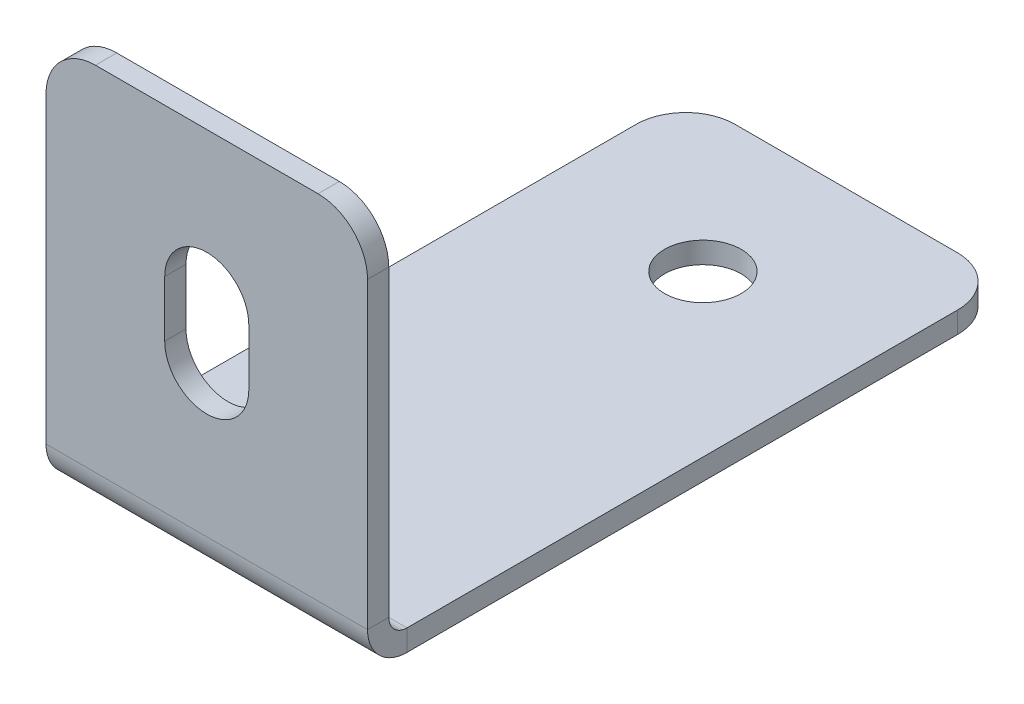
ISO-10303-21;
HEADER;
FILE_DESCRIPTION(('STEP AP214'),'2;1');
FILE_NAME('part.step','',(''),(''),'','','');
FILE_SCHEMA(('AUTOMOTIVE_DESIGN { 1 0 10303 214 1 1 1 1 }'));
ENDSEC;
DATA;
#1=APPLICATION_CONTEXT('core data for automotive mechanical design processes');
#2=APPLICATION_PROTOCOL_DEFINITION('international standard','automotive_design',2000,#1);
#3=PRODUCT_CONTEXT('',#1,'mechanical');
#4=PRODUCT('Part','Part','',(#3));
#5=PRODUCT_RELATED_PRODUCT_CATEGORY('part','',(#4));
#6=PRODUCT_DEFINITION_FORMATION('','',#4);
#7=PRODUCT_DEFINITION_CONTEXT('part definition',#1,'design');
#8=PRODUCT_DEFINITION('design','',#6,#7);
#9=PRODUCT_DEFINITION_SHAPE('','',#8);
#10=(LENGTH_UNIT() NAMED_UNIT(*) SI_UNIT(.MILLI.,.METRE.));
#11=(NAMED_UNIT(*) PLANE_ANGLE_UNIT() SI_UNIT($,.RADIAN.));
#12=(NAMED_UNIT(*) SI_UNIT($,.STERADIAN.) SOLID_ANGLE_UNIT());
#13=UNCERTAINTY_MEASURE_WITH_UNIT(LENGTH_MEASURE(1.E-05),#10,'distance_accuracy_value','');
#14=(GEOMETRIC_REPRESENTATION_CONTEXT(3) GLOBAL_UNCERTAINTY_ASSIGNED_CONTEXT((#13)) GLOBAL_UNIT_ASSIGNED_CONTEXT((#10,
#11,#12)) REPRESENTATION_CONTEXT('',''));
#15=CARTESIAN_POINT('',(0.,0.,0.));
#16=DIRECTION('',(0.,0.,1.));
#17=DIRECTION('',(1.,0.,0.));
#18=AXIS2_PLACEMENT_3D('',#15,#16,#17);
#19=CARTESIAN_POINT('',(0.,0.,13.36));
#20=DIRECTION('',(0.,0.,-1.));
#21=DIRECTION('',(-1.,0.,0.));
#22=AXIS2_PLACEMENT_3D('',#19,#20,#21);
#23=PLANE('',#22);
#24=DIRECTION('',(-1.,0.,0.));
#25=VECTOR('',#24,1.);
#26=CARTESIAN_POINT('',(-6.5,15.,13.36));
#27=LINE('',#26,#25);
#28=CARTESIAN_POINT('',(4.49999999999999,15.,13.36));
#29=VERTEX_POINT('',#28);
#30=CARTESIAN_POINT('',(-4.5,15.,13.36));
#31=VERTEX_POINT('',#30);
#32=EDGE_CURVE('E206',#29,#31,#27,.T.);
#33=ORIENTED_EDGE('',*,*,#32,.T.);
#34=CARTESIAN_POINT('',(-4.5,13.,13.36));
#35=DIRECTION('',(0.,0.,-1.));
#36=DIRECTION('',(-1.,0.,0.));
#37=AXIS2_PLACEMENT_3D('',#34,#35,#36);
#38=CIRCLE('',#37,2.);
#39=CARTESIAN_POINT('',(-6.5,13.,13.36));
#40=VERTEX_POINT('',#39);
#41=EDGE_CURVE('E269',#31,#40,#38,.F.);
#42=ORIENTED_EDGE('',*,*,#41,.T.);
#43=DIRECTION('',(0.,-1.,0.));
#44=VECTOR('',#43,1.);
#45=CARTESIAN_POINT('',(-6.5,0.,13.36));
#46=LINE('',#45,#44);
#47=CARTESIAN_POINT('',(-6.5,0.736599999999997,13.36));
#48=VERTEX_POINT('',#47);
#49=EDGE_CURVE('E200',#40,#48,#46,.T.);
#50=ORIENTED_EDGE('',*,*,#49,.T.);
#51=DIRECTION('',(-1.,0.,0.));
#52=VECTOR('',#51,1.);
#53=CARTESIAN_POINT('',(0.,0.736599999999997,13.36));
#54=LINE('',#53,#52);
#55=CARTESIAN_POINT('',(6.5,0.736599999999997,13.36));
#56=VERTEX_POINT('',#55);
#57=EDGE_CURVE('E194',#56,#48,#54,.T.);
#58=ORIENTED_EDGE('',*,*,#57,.F.);
#59=DIRECTION('',(0.,1.,0.));
#60=VECTOR('',#59,1.);
#61=CARTESIAN_POINT('',(6.5,15.,13.36));
#62=LINE('',#61,#60);
#63=CARTESIAN_POINT('',(6.5,13.,13.36));
#64=VERTEX_POINT('',#63);
#65=EDGE_CURVE('E202',#56,#64,#62,.T.);
#66=ORIENTED_EDGE('',*,*,#65,.T.);
#67=CARTESIAN_POINT('',(4.5,13.,13.36));
#68=DIRECTION('',(0.,0.,-1.));
#69=DIRECTION('',(-1.,0.,0.));
#70=AXIS2_PLACEMENT_3D('',#67,#68,#69);
#71=CIRCLE('',#70,2.);
#72=EDGE_CURVE('E267',#64,#29,#71,.F.);
#73=ORIENTED_EDGE('',*,*,#72,.T.);
#74=EDGE_LOOP('',(#33,#42,#50,#58,#66,#73));
#75=FACE_BOUND('',#74,.T.);
#76=DIRECTION('',(0.,-1.,0.));
#77=VECTOR('',#76,1.);
#78=CARTESIAN_POINT('',(-1.7,9.,13.36));
#79=LINE('',#78,#77);
#80=CARTESIAN_POINT('',(-1.7,9.,13.36));
#81=VERTEX_POINT('',#80);
#82=CARTESIAN_POINT('',(-1.7,6.7366,13.36));
#83=VERTEX_POINT('',#82);
#84=EDGE_CURVE('E146',#81,#83,#79,.T.);
#85=ORIENTED_EDGE('',*,*,#84,.F.);
#86=CARTESIAN_POINT('',(0.,9.,13.36));
#87=DIRECTION('',(0.,0.,-1.));
#88=DIRECTION('',(-1.,0.,0.));
#89=AXIS2_PLACEMENT_3D('',#86,#87,#88);
#90=CIRCLE('',#89,1.7);
#91=CARTESIAN_POINT('',(1.7,9.,13.36));
#92=VERTEX_POINT('',#91);
#93=EDGE_CURVE('E168',#81,#92,#90,.T.);
#94=ORIENTED_EDGE('',*,*,#93,.T.);
#95=DIRECTION('',(0.,-1.,0.));
#96=VECTOR('',#95,1.);
#97=CARTESIAN_POINT('',(1.7,9.,13.36));
#98=LINE('',#97,#96);
#99=CARTESIAN_POINT('',(1.7,6.7366,13.36));
#100=VERTEX_POINT('',#99);
#101=EDGE_CURVE('E50',#92,#100,#98,.T.);
#102=ORIENTED_EDGE('',*,*,#101,.T.);
#103=CARTESIAN_POINT('',(0.,6.7366,13.36));
#104=DIRECTION('',(0.,0.,-1.));
#105=DIRECTION('',(-1.,0.,0.));
#106=AXIS2_PLACEMENT_3D('',#103,#104,#105);
#107=CIRCLE('',#106,1.7);
#108=EDGE_CURVE('E156',#100,#83,#107,.T.);
#109=ORIENTED_EDGE('',*,*,#108,.T.);
#110=EDGE_LOOP('',(#85,#94,#102,#109));
#111=FACE_BOUND('',#110,.T.);
#112=ADVANCED_FACE('F35',(#75,#111),#23,.F.);
#113=CARTESIAN_POINT('',(0.,0.,12.5));
#114=DIRECTION('',(0.,0.,-1.));
#115=DIRECTION('',(-1.,0.,0.));
#116=AXIS2_PLACEMENT_3D('',#113,#114,#115);
#117=PLANE('',#116);
#118=DIRECTION('',(0.,-1.,0.));
#119=VECTOR('',#118,1.);
#120=CARTESIAN_POINT('',(-6.5,0.,12.5));
#121=LINE('',#120,#119);
#122=CARTESIAN_POINT('',(-6.5,13.,12.5));
#123=VERTEX_POINT('',#122);
#124=CARTESIAN_POINT('',(-6.5,0.736599999999997,12.5));
#125=VERTEX_POINT('',#124);
#126=EDGE_CURVE('E199',#123,#125,#121,.T.);
#127=ORIENTED_EDGE('',*,*,#126,.F.);
#128=CARTESIAN_POINT('',(-4.5,13.,12.5));
#129=DIRECTION('',(0.,0.,-1.));
#130=DIRECTION('',(-1.,0.,0.));
#131=AXIS2_PLACEMENT_3D('',#128,#129,#130);
#132=CIRCLE('',#131,2.);
#133=CARTESIAN_POINT('',(-4.5,15.,12.5));
#134=VERTEX_POINT('',#133);
#135=EDGE_CURVE('E260',#123,#134,#132,.T.);
#136=ORIENTED_EDGE('',*,*,#135,.T.);
#137=DIRECTION('',(-1.,0.,0.));
#138=VECTOR('',#137,1.);
#139=CARTESIAN_POINT('',(-6.5,15.,12.5));
#140=LINE('',#139,#138);
#141=CARTESIAN_POINT('',(4.49999999999999,15.,12.5));
#142=VERTEX_POINT('',#141);
#143=EDGE_CURVE('E203',#142,#134,#140,.T.);
#144=ORIENTED_EDGE('',*,*,#143,.F.);
#145=CARTESIAN_POINT('',(4.5,13.,12.5));
#146=DIRECTION('',(0.,0.,-1.));
#147=DIRECTION('',(-1.,0.,0.));
#148=AXIS2_PLACEMENT_3D('',#145,#146,#147);
#149=CIRCLE('',#148,2.);
#150=CARTESIAN_POINT('',(6.5,13.,12.5));
#151=VERTEX_POINT('',#150);
#152=EDGE_CURVE('E258',#142,#151,#149,.T.);
#153=ORIENTED_EDGE('',*,*,#152,.T.);
#154=DIRECTION('',(0.,1.,0.));
#155=VECTOR('',#154,1.);
#156=CARTESIAN_POINT('',(6.5,15.,12.5));
#157=LINE('',#156,#155);
#158=CARTESIAN_POINT('',(6.5,0.736599999999997,12.5));
#159=VERTEX_POINT('',#158);
#160=EDGE_CURVE('E211',#159,#151,#157,.T.);
#161=ORIENTED_EDGE('',*,*,#160,.F.);
#162=DIRECTION('',(1.,0.,0.));
#163=VECTOR('',#162,1.);
#164=CARTESIAN_POINT('',(-6.5,0.736599999999997,12.5));
#165=LINE('',#164,#163);
#166=EDGE_CURVE('E189',#125,#159,#165,.T.);
#167=ORIENTED_EDGE('',*,*,#166,.F.);
#168=EDGE_LOOP('',(#127,#136,#144,#153,#161,#167));
#169=FACE_BOUND('',#168,.T.);
#170=CARTESIAN_POINT('',(0.,9.,12.5));
#171=DIRECTION('',(0.,0.,-1.));
#172=DIRECTION('',(-1.,0.,0.));
#173=AXIS2_PLACEMENT_3D('',#170,#171,#172);
#174=CIRCLE('',#173,1.7);
#175=CARTESIAN_POINT('',(-1.7,9.,12.5));
#176=VERTEX_POINT('',#175);
#177=CARTESIAN_POINT('',(1.7,9.,12.5));
#178=VERTEX_POINT('',#177);
#179=EDGE_CURVE('E157',#176,#178,#174,.T.);
#180=ORIENTED_EDGE('',*,*,#179,.F.);
#181=DIRECTION('',(0.,-1.,0.));
#182=VECTOR('',#181,1.);
#183=CARTESIAN_POINT('',(-1.7,9.,12.5));
#184=LINE('',#183,#182);
#185=CARTESIAN_POINT('',(-1.7,6.7366,12.5));
#186=VERTEX_POINT('',#185);
#187=EDGE_CURVE('E58',#176,#186,#184,.T.);
#188=ORIENTED_EDGE('',*,*,#187,.T.);
#189=CARTESIAN_POINT('',(0.,6.7366,12.5));
#190=DIRECTION('',(0.,0.,-1.));
#191=DIRECTION('',(-1.,0.,0.));
#192=AXIS2_PLACEMENT_3D('',#189,#190,#191);
#193=CIRCLE('',#192,1.7);
#194=CARTESIAN_POINT('',(1.7,6.7366,12.5));
#195=VERTEX_POINT('',#194);
#196=EDGE_CURVE('E163',#195,#186,#193,.T.);
#197=ORIENTED_EDGE('',*,*,#196,.F.);
#198=DIRECTION('',(0.,-1.,0.));
#199=VECTOR('',#198,1.);
#200=CARTESIAN_POINT('',(1.7,9.,12.5));
#201=LINE('',#200,#199);
#202=EDGE_CURVE('E174',#178,#195,#201,.T.);
#203=ORIENTED_EDGE('',*,*,#202,.F.);
#204=EDGE_LOOP('',(#180,#188,#197,#203));
#205=FACE_BOUND('',#204,.T.);
#206=ADVANCED_FACE('F333',(#169,#205),#117,.T.);
#207=CARTESIAN_POINT('',(6.5,-0.86,12.5));
#208=DIRECTION('',(1.,0.,0.));
#209=DIRECTION('',(0.,0.,-1.));
#210=AXIS2_PLACEMENT_3D('',#207,#208,#209);
#211=PLANE('',#210);
#212=DIRECTION('',(0.,0.,-1.));
#213=VECTOR('',#212,1.);
#214=CARTESIAN_POINT('',(6.5,-0.86,12.5));
#215=LINE('',#214,#213);
#216=CARTESIAN_POINT('',(6.5,-0.860000000000004,11.7634));
#217=VERTEX_POINT('',#216);
#218=CARTESIAN_POINT('',(6.5,-0.86,-10.5));
#219=VERTEX_POINT('',#218);
#220=EDGE_CURVE('E240',#217,#219,#215,.T.);
#221=ORIENTED_EDGE('',*,*,#220,.T.);
#222=DIRECTION('',(0.,1.,0.));
#223=VECTOR('',#222,1.);
#224=CARTESIAN_POINT('',(6.5,-0.86,-10.5));
#225=LINE('',#224,#223);
#226=CARTESIAN_POINT('',(6.5,0.,-10.5));
#227=VERTEX_POINT('',#226);
#228=EDGE_CURVE('E11',#219,#227,#225,.T.);
#229=ORIENTED_EDGE('',*,*,#228,.T.);
#230=DIRECTION('',(0.,0.,-1.));
#231=VECTOR('',#230,1.);
#232=CARTESIAN_POINT('',(6.5,0.,12.5));
#233=LINE('',#232,#231);
#234=CARTESIAN_POINT('',(6.5,0.,11.7634));
#235=VERTEX_POINT('',#234);
#236=EDGE_CURVE('E237',#235,#227,#233,.T.);
#237=ORIENTED_EDGE('',*,*,#236,.F.);
#238=DIRECTION('',(0.,-1.,0.));
#239=VECTOR('',#238,1.);
#240=CARTESIAN_POINT('',(6.5,0.,11.7634));
#241=LINE('',#240,#239);
#242=EDGE_CURVE('E223',#235,#217,#241,.T.);
#243=ORIENTED_EDGE('',*,*,#242,.T.);
#244=EDGE_LOOP('',(#221,#229,#237,#243));
#245=FACE_BOUND('',#244,.T.);
#246=ADVANCED_FACE('F321',(#245),#211,.T.);
#247=CARTESIAN_POINT('',(0.,-0.86,0.));
#248=DIRECTION('',(0.,-1.,0.));
#249=DIRECTION('',(0.,0.,-1.));
#250=AXIS2_PLACEMENT_3D('',#247,#248,#249);
#251=PLANE('',#250);
#252=CARTESIAN_POINT('',(0.,-0.860000000000004,-6.70000000000001));
#253=DIRECTION('',(0.,1.,0.));
#254=DIRECTION('',(0.,0.,1.));
#255=AXIS2_PLACEMENT_3D('',#252,#253,#254);
#256=CIRCLE('',#255,1.55);
#257=CARTESIAN_POINT('',(0.,-0.860000000000004,-5.15000000000001));
#258=VERTEX_POINT('',#257);
#259=EDGE_CURVE('E183',#258,#258,#256,.T.);
#260=ORIENTED_EDGE('',*,*,#259,.T.);
#261=EDGE_LOOP('',(#260));
#262=FACE_BOUND('',#261,.T.);
#263=DIRECTION('',(0.,0.,1.));
#264=VECTOR('',#263,1.);
#265=CARTESIAN_POINT('',(-6.5,-0.86,12.5));
#266=LINE('',#265,#264);
#267=CARTESIAN_POINT('',(-6.5,-0.86,-10.5));
#268=VERTEX_POINT('',#267);
#269=CARTESIAN_POINT('',(-6.5,-0.86,11.7634));
#270=VERTEX_POINT('',#269);
#271=EDGE_CURVE('E247',#268,#270,#266,.T.);
#272=ORIENTED_EDGE('',*,*,#271,.F.);
#273=CARTESIAN_POINT('',(-4.5,-0.86,-10.5));
#274=DIRECTION('',(0.,-1.,0.));
#275=DIRECTION('',(0.,0.,-1.));
#276=AXIS2_PLACEMENT_3D('',#273,#274,#275);
#277=CIRCLE('',#276,2.);
#278=CARTESIAN_POINT('',(-4.5,-0.86,-12.5));
#279=VERTEX_POINT('',#278);
#280=EDGE_CURVE('E43',#268,#279,#277,.T.);
#281=ORIENTED_EDGE('',*,*,#280,.T.);
#282=DIRECTION('',(-1.,0.,0.));
#283=VECTOR('',#282,1.);
#284=CARTESIAN_POINT('',(-6.5,-0.86,-12.5));
#285=LINE('',#284,#283);
#286=CARTESIAN_POINT('',(4.5,-0.86,-12.5));
#287=VERTEX_POINT('',#286);
#288=EDGE_CURVE('E243',#287,#279,#285,.T.);
#289=ORIENTED_EDGE('',*,*,#288,.F.);
#290=CARTESIAN_POINT('',(4.5,-0.86,-10.5));
#291=DIRECTION('',(0.,-1.,0.));
#292=DIRECTION('',(0.,0.,-1.));
#293=AXIS2_PLACEMENT_3D('',#290,#291,#292);
#294=CIRCLE('',#293,2.);
#295=EDGE_CURVE('E284',#287,#219,#294,.T.);
#296=ORIENTED_EDGE('',*,*,#295,.T.);
#297=ORIENTED_EDGE('',*,*,#220,.F.);
#298=DIRECTION('',(1.,0.,0.));
#299=VECTOR('',#298,1.);
#300=CARTESIAN_POINT('',(6.5,-0.860000000000004,11.7634));
#301=LINE('',#300,#299);
#302=EDGE_CURVE('E216',#217,#270,#301,.F.);
#303=ORIENTED_EDGE('',*,*,#302,.T.);
#304=EDGE_LOOP('',(#272,#281,#289,#296,#297,#303));
#305=FACE_BOUND('',#304,.T.);
#306=ADVANCED_FACE('F289',(#262,#305),#251,.T.);
#307=CARTESIAN_POINT('',(0.,0.,0.));
#308=DIRECTION('',(0.,-1.,0.));
#309=DIRECTION('',(0.,0.,-1.));
#310=AXIS2_PLACEMENT_3D('',#307,#308,#309);
#311=PLANE('',#310);
#312=CARTESIAN_POINT('',(0.,0.,-6.70000000000001));
#313=DIRECTION('',(0.,1.,0.));
#314=DIRECTION('',(0.,0.,1.));
#315=AXIS2_PLACEMENT_3D('',#312,#313,#314);
#316=CIRCLE('',#315,1.55);
#317=CARTESIAN_POINT('',(0.,0.,-5.15000000000001));
#318=VERTEX_POINT('',#317);
#319=EDGE_CURVE('E164',#318,#318,#316,.T.);
#320=ORIENTED_EDGE('',*,*,#319,.F.);
#321=EDGE_LOOP('',(#320));
#322=FACE_BOUND('',#321,.T.);
#323=DIRECTION('',(-1.,0.,0.));
#324=VECTOR('',#323,1.);
#325=CARTESIAN_POINT('',(-6.5,0.,-12.5));
#326=LINE('',#325,#324);
#327=CARTESIAN_POINT('',(4.5,0.,-12.5));
#328=VERTEX_POINT('',#327);
#329=CARTESIAN_POINT('',(-4.5,0.,-12.5));
#330=VERTEX_POINT('',#329);
#331=EDGE_CURVE('E252',#328,#330,#326,.T.);
#332=ORIENTED_EDGE('',*,*,#331,.T.);
#333=CARTESIAN_POINT('',(-4.5,0.,-10.5));
#334=DIRECTION('',(0.,-1.,0.));
#335=DIRECTION('',(0.,0.,-1.));
#336=AXIS2_PLACEMENT_3D('',#333,#334,#335);
#337=CIRCLE('',#336,2.);
#338=CARTESIAN_POINT('',(-6.5,0.,-10.5));
#339=VERTEX_POINT('',#338);
#340=EDGE_CURVE('E280',#330,#339,#337,.F.);
#341=ORIENTED_EDGE('',*,*,#340,.T.);
#342=DIRECTION('',(0.,0.,1.));
#343=VECTOR('',#342,1.);
#344=CARTESIAN_POINT('',(-6.5,0.,12.5));
#345=LINE('',#344,#343);
#346=CARTESIAN_POINT('',(-6.5,0.,11.7634));
#347=VERTEX_POINT('',#346);
#348=EDGE_CURVE('E244',#339,#347,#345,.T.);
#349=ORIENTED_EDGE('',*,*,#348,.T.);
#350=DIRECTION('',(1.,0.,0.));
#351=VECTOR('',#350,1.);
#352=CARTESIAN_POINT('',(6.5,0.,11.7634));
#353=LINE('',#352,#351);
#354=EDGE_CURVE('E229',#235,#347,#353,.F.);
#355=ORIENTED_EDGE('',*,*,#354,.F.);
#356=ORIENTED_EDGE('',*,*,#236,.T.);
#357=CARTESIAN_POINT('',(4.5,0.,-10.5));
#358=DIRECTION('',(0.,-1.,0.));
#359=DIRECTION('',(0.,0.,-1.));
#360=AXIS2_PLACEMENT_3D('',#357,#358,#359);
#361=CIRCLE('',#360,2.);
#362=EDGE_CURVE('E278',#227,#328,#361,.F.);
#363=ORIENTED_EDGE('',*,*,#362,.T.);
#364=EDGE_LOOP('',(#332,#341,#349,#355,#356,#363));
#365=FACE_BOUND('',#364,.T.);
#366=ADVANCED_FACE('F301',(#322,#365),#311,.F.);
#367=CARTESIAN_POINT('',(-6.5,-0.86,12.5));
#368=DIRECTION('',(-1.,0.,0.));
#369=DIRECTION('',(0.,0.,1.));
#370=AXIS2_PLACEMENT_3D('',#367,#368,#369);
#371=PLANE('',#370);
#372=ORIENTED_EDGE('',*,*,#348,.F.);
#373=DIRECTION('',(0.,1.,0.));
#374=VECTOR('',#373,1.);
#375=CARTESIAN_POINT('',(-6.5,-0.86,-10.5));
#376=LINE('',#375,#374);
#377=EDGE_CURVE('E282',#339,#268,#376,.F.);
#378=ORIENTED_EDGE('',*,*,#377,.T.);
#379=ORIENTED_EDGE('',*,*,#271,.T.);
#380=DIRECTION('',(0.,-1.,0.));
#381=VECTOR('',#380,1.);
#382=CARTESIAN_POINT('',(-6.5,0.,11.7634));
#383=LINE('',#382,#381);
#384=EDGE_CURVE('E234',#347,#270,#383,.T.);
#385=ORIENTED_EDGE('',*,*,#384,.F.);
#386=EDGE_LOOP('',(#372,#378,#379,#385));
#387=FACE_BOUND('',#386,.T.);
#388=ADVANCED_FACE('F305',(#387),#371,.T.);
#389=CARTESIAN_POINT('',(-6.5,-0.86,-12.5));
#390=DIRECTION('',(0.,0.,-1.));
#391=DIRECTION('',(-1.,0.,0.));
#392=AXIS2_PLACEMENT_3D('',#389,#390,#391);
#393=PLANE('',#392);
#394=ORIENTED_EDGE('',*,*,#288,.T.);
#395=DIRECTION('',(0.,1.,0.));
#396=VECTOR('',#395,1.);
#397=CARTESIAN_POINT('',(-4.5,-0.86,-12.5));
#398=LINE('',#397,#396);
#399=EDGE_CURVE('E275',#279,#330,#398,.T.);
#400=ORIENTED_EDGE('',*,*,#399,.T.);
#401=ORIENTED_EDGE('',*,*,#331,.F.);
#402=DIRECTION('',(0.,1.,0.));
#403=VECTOR('',#402,1.);
#404=CARTESIAN_POINT('',(4.5,-0.86,-12.5));
#405=LINE('',#404,#403);
#406=EDGE_CURVE('E273',#328,#287,#405,.F.);
#407=ORIENTED_EDGE('',*,*,#406,.T.);
#408=EDGE_LOOP('',(#394,#400,#401,#407));
#409=FACE_BOUND('',#408,.T.);
#410=ADVANCED_FACE('F295',(#409),#393,.T.);
#411=CARTESIAN_POINT('',(-6.5,0.736599999999997,11.7634));
#412=DIRECTION('',(-1.,0.,0.));
#413=DIRECTION('',(0.,0.,1.));
#414=AXIS2_PLACEMENT_3D('',#411,#412,#413);
#415=PLANE('',#414);
#416=DIRECTION('',(0.,0.,1.));
#417=VECTOR('',#416,1.);
#418=CARTESIAN_POINT('',(-6.5,0.736599999999997,12.5));
#419=LINE('',#418,#417);
#420=EDGE_CURVE('E186',#125,#48,#419,.T.);
#421=ORIENTED_EDGE('',*,*,#420,.F.);
#422=CARTESIAN_POINT('',(-6.5,0.736599999999997,11.7634));
#423=DIRECTION('',(1.,0.,0.));
#424=DIRECTION('',(0.,0.,-1.));
#425=AXIS2_PLACEMENT_3D('',#422,#423,#424);
#426=CIRCLE('',#425,0.7366);
#427=EDGE_CURVE('E226',#347,#125,#426,.F.);
#428=ORIENTED_EDGE('',*,*,#427,.F.);
#429=ORIENTED_EDGE('',*,*,#384,.T.);
#430=CARTESIAN_POINT('',(-6.5,0.736599999999997,11.7634));
#431=DIRECTION('',(1.,0.,0.));
#432=DIRECTION('',(0.,0.,-1.));
#433=AXIS2_PLACEMENT_3D('',#430,#431,#432);
#434=CIRCLE('',#433,1.5966);
#435=EDGE_CURVE('E219',#270,#48,#434,.F.);
#436=ORIENTED_EDGE('',*,*,#435,.T.);
#437=EDGE_LOOP('',(#421,#428,#429,#436));
#438=FACE_BOUND('',#437,.T.);
#439=ADVANCED_FACE('F310',(#438),#415,.T.);
#440=CARTESIAN_POINT('',(6.5,0.736599999999997,11.7634));
#441=DIRECTION('',(-1.,0.,0.));
#442=DIRECTION('',(0.,0.,1.));
#443=AXIS2_PLACEMENT_3D('',#440,#441,#442);
#444=PLANE('',#443);
#445=CARTESIAN_POINT('',(6.5,0.736599999999997,11.7634));
#446=DIRECTION('',(1.,0.,0.));
#447=DIRECTION('',(0.,0.,-1.));
#448=AXIS2_PLACEMENT_3D('',#445,#446,#447);
#449=CIRCLE('',#448,0.7366);
#450=EDGE_CURVE('E209',#159,#235,#449,.T.);
#451=ORIENTED_EDGE('',*,*,#450,.F.);
#452=DIRECTION('',(0.,0.,1.));
#453=VECTOR('',#452,1.);
#454=CARTESIAN_POINT('',(6.5,0.736599999999997,12.5));
#455=LINE('',#454,#453);
#456=EDGE_CURVE('E191',#159,#56,#455,.T.);
#457=ORIENTED_EDGE('',*,*,#456,.T.);
#458=CARTESIAN_POINT('',(6.5,0.736599999999997,11.7634));
#459=DIRECTION('',(1.,0.,0.));
#460=DIRECTION('',(0.,0.,-1.));
#461=AXIS2_PLACEMENT_3D('',#458,#459,#460);
#462=CIRCLE('',#461,1.5966);
#463=EDGE_CURVE('E220',#56,#217,#462,.T.);
#464=ORIENTED_EDGE('',*,*,#463,.T.);
#465=ORIENTED_EDGE('',*,*,#242,.F.);
#466=EDGE_LOOP('',(#451,#457,#464,#465));
#467=FACE_BOUND('',#466,.T.);
#468=ADVANCED_FACE('F316',(#467),#444,.F.);
#469=CARTESIAN_POINT('',(6.5,0.736599999999997,11.7634));
#470=DIRECTION('',(1.,0.,0.));
#471=DIRECTION('',(0.,0.,1.));
#472=AXIS2_PLACEMENT_3D('',#469,#470,#471);
#473=CYLINDRICAL_SURFACE('',#472,1.5966);
#474=ORIENTED_EDGE('',*,*,#302,.F.);
#475=ORIENTED_EDGE('',*,*,#463,.F.);
#476=ORIENTED_EDGE('',*,*,#57,.T.);
#477=ORIENTED_EDGE('',*,*,#435,.F.);
#478=EDGE_LOOP('',(#474,#475,#476,#477));
#479=FACE_BOUND('',#478,.T.);
#480=ADVANCED_FACE('F313',(#479),#473,.T.);
#481=CARTESIAN_POINT('',(6.5,0.736599999999997,11.7634));
#482=DIRECTION('',(1.,0.,0.));
#483=DIRECTION('',(0.,0.,1.));
#484=AXIS2_PLACEMENT_3D('',#481,#482,#483);
#485=CYLINDRICAL_SURFACE('',#484,0.7366);
#486=ORIENTED_EDGE('',*,*,#354,.T.);
#487=ORIENTED_EDGE('',*,*,#427,.T.);
#488=ORIENTED_EDGE('',*,*,#166,.T.);
#489=ORIENTED_EDGE('',*,*,#450,.T.);
#490=EDGE_LOOP('',(#486,#487,#488,#489));
#491=FACE_BOUND('',#490,.T.);
#492=ADVANCED_FACE('F324',(#491),#485,.F.);
#493=CARTESIAN_POINT('',(-6.5,0.,13.36));
#494=DIRECTION('',(1.,0.,0.));
#495=DIRECTION('',(0.,1.,0.));
#496=AXIS2_PLACEMENT_3D('',#493,#494,#495);
#497=PLANE('',#496);
#498=ORIENTED_EDGE('',*,*,#49,.F.);
#499=DIRECTION('',(0.,0.,-1.));
#500=VECTOR('',#499,1.);
#501=CARTESIAN_POINT('',(-6.5,13.,13.36));
#502=LINE('',#501,#500);
#503=EDGE_CURVE('E249',#40,#123,#502,.T.);
#504=ORIENTED_EDGE('',*,*,#503,.T.);
#505=ORIENTED_EDGE('',*,*,#126,.T.);
#506=ORIENTED_EDGE('',*,*,#420,.T.);
#507=EDGE_LOOP('',(#498,#504,#505,#506));
#508=FACE_BOUND('',#507,.T.);
#509=ADVANCED_FACE('F351',(#508),#497,.F.);
#510=CARTESIAN_POINT('',(6.5,15.,13.36));
#511=DIRECTION('',(-1.,0.,0.));
#512=DIRECTION('',(0.,-1.,0.));
#513=AXIS2_PLACEMENT_3D('',#510,#511,#512);
#514=PLANE('',#513);
#515=ORIENTED_EDGE('',*,*,#160,.T.);
#516=DIRECTION('',(0.,0.,-1.));
#517=VECTOR('',#516,1.);
#518=CARTESIAN_POINT('',(6.5,13.,13.36));
#519=LINE('',#518,#517);
#520=EDGE_CURVE('E271',#151,#64,#519,.F.);
#521=ORIENTED_EDGE('',*,*,#520,.T.);
#522=ORIENTED_EDGE('',*,*,#65,.F.);
#523=ORIENTED_EDGE('',*,*,#456,.F.);
#524=EDGE_LOOP('',(#515,#521,#522,#523));
#525=FACE_BOUND('',#524,.T.);
#526=ADVANCED_FACE('F329',(#525),#514,.F.);
#527=CARTESIAN_POINT('',(-6.5,15.,13.36));
#528=DIRECTION('',(0.,-1.,0.));
#529=DIRECTION('',(0.,0.,-1.));
#530=AXIS2_PLACEMENT_3D('',#527,#528,#529);
#531=PLANE('',#530);
#532=ORIENTED_EDGE('',*,*,#143,.T.);
#533=DIRECTION('',(0.,0.,-1.));
#534=VECTOR('',#533,1.);
#535=CARTESIAN_POINT('',(-4.5,15.,13.36));
#536=LINE('',#535,#534);
#537=EDGE_CURVE('E265',#134,#31,#536,.F.);
#538=ORIENTED_EDGE('',*,*,#537,.T.);
#539=ORIENTED_EDGE('',*,*,#32,.F.);
#540=DIRECTION('',(0.,0.,-1.));
#541=VECTOR('',#540,1.);
#542=CARTESIAN_POINT('',(4.5,15.,13.36));
#543=LINE('',#542,#541);
#544=EDGE_CURVE('E262',#29,#142,#543,.T.);
#545=ORIENTED_EDGE('',*,*,#544,.T.);
#546=EDGE_LOOP('',(#532,#538,#539,#545));
#547=FACE_BOUND('',#546,.T.);
#548=ADVANCED_FACE('F342',(#547),#531,.F.);
#549=CARTESIAN_POINT('',(-4.5,13.,13.36));
#550=DIRECTION('',(0.,0.,-1.));
#551=DIRECTION('',(-1.,0.,0.));
#552=AXIS2_PLACEMENT_3D('',#549,#550,#551);
#553=CYLINDRICAL_SURFACE('',#552,2.);
#554=ORIENTED_EDGE('',*,*,#41,.F.);
#555=ORIENTED_EDGE('',*,*,#537,.F.);
#556=ORIENTED_EDGE('',*,*,#135,.F.);
#557=ORIENTED_EDGE('',*,*,#503,.F.);
#558=EDGE_LOOP('',(#554,#555,#556,#557));
#559=FACE_BOUND('',#558,.T.);
#560=ADVANCED_FACE('F349',(#559),#553,.T.);
#561=CARTESIAN_POINT('',(4.5,13.,13.36));
#562=DIRECTION('',(0.,0.,-1.));
#563=DIRECTION('',(-1.,0.,0.));
#564=AXIS2_PLACEMENT_3D('',#561,#562,#563);
#565=CYLINDRICAL_SURFACE('',#564,2.);
#566=ORIENTED_EDGE('',*,*,#72,.F.);
#567=ORIENTED_EDGE('',*,*,#520,.F.);
#568=ORIENTED_EDGE('',*,*,#152,.F.);
#569=ORIENTED_EDGE('',*,*,#544,.F.);
#570=EDGE_LOOP('',(#566,#567,#568,#569));
#571=FACE_BOUND('',#570,.T.);
#572=ADVANCED_FACE('F339',(#571),#565,.T.);
#573=CARTESIAN_POINT('',(-4.5,-0.86,-10.5));
#574=DIRECTION('',(0.,1.,0.));
#575=DIRECTION('',(0.,0.,1.));
#576=AXIS2_PLACEMENT_3D('',#573,#574,#575);
#577=CYLINDRICAL_SURFACE('',#576,2.);
#578=ORIENTED_EDGE('',*,*,#280,.F.);
#579=ORIENTED_EDGE('',*,*,#377,.F.);
#580=ORIENTED_EDGE('',*,*,#340,.F.);
#581=ORIENTED_EDGE('',*,*,#399,.F.);
#582=EDGE_LOOP('',(#578,#579,#580,#581));
#583=FACE_BOUND('',#582,.T.);
#584=ADVANCED_FACE('F298',(#583),#577,.T.);
#585=CARTESIAN_POINT('',(4.5,-0.86,-10.5));
#586=DIRECTION('',(0.,1.,0.));
#587=DIRECTION('',(0.,0.,1.));
#588=AXIS2_PLACEMENT_3D('',#585,#586,#587);
#589=CYLINDRICAL_SURFACE('',#588,2.);
#590=ORIENTED_EDGE('',*,*,#295,.F.);
#591=ORIENTED_EDGE('',*,*,#406,.F.);
#592=ORIENTED_EDGE('',*,*,#362,.F.);
#593=ORIENTED_EDGE('',*,*,#228,.F.);
#594=EDGE_LOOP('',(#590,#591,#592,#593));
#595=FACE_BOUND('',#594,.T.);
#596=ADVANCED_FACE('F37',(#595),#589,.T.);
#597=CARTESIAN_POINT('',(0.,-0.860000000000004,-6.70000000000001));
#598=DIRECTION('',(0.,1.,0.));
#599=DIRECTION('',(0.,0.,1.));
#600=AXIS2_PLACEMENT_3D('',#597,#598,#599);
#601=CYLINDRICAL_SURFACE('',#600,1.55);
#602=ORIENTED_EDGE('',*,*,#259,.F.);
#603=EDGE_LOOP('',(#602));
#604=FACE_BOUND('',#603,.T.);
#605=ORIENTED_EDGE('',*,*,#319,.T.);
#606=EDGE_LOOP('',(#605));
#607=FACE_BOUND('',#606,.T.);
#608=ADVANCED_FACE('F368',(#604,#607),#601,.F.);
#609=CARTESIAN_POINT('',(-1.7,9.,13.36));
#610=DIRECTION('',(1.,0.,0.));
#611=DIRECTION('',(0.,1.,0.));
#612=AXIS2_PLACEMENT_3D('',#609,#610,#611);
#613=PLANE('',#612);
#614=ORIENTED_EDGE('',*,*,#187,.F.);
#615=DIRECTION('',(0.,0.,-1.));
#616=VECTOR('',#615,1.);
#617=CARTESIAN_POINT('',(-1.7,9.,13.36));
#618=LINE('',#617,#616);
#619=EDGE_CURVE('E151',#81,#176,#618,.T.);
#620=ORIENTED_EDGE('',*,*,#619,.F.);
#621=ORIENTED_EDGE('',*,*,#84,.T.);
#622=DIRECTION('',(0.,0.,-1.));
#623=VECTOR('',#622,1.);
#624=CARTESIAN_POINT('',(-1.7,6.7366,13.36));
#625=LINE('',#624,#623);
#626=EDGE_CURVE('E149',#83,#186,#625,.T.);
#627=ORIENTED_EDGE('',*,*,#626,.T.);
#628=EDGE_LOOP('',(#614,#620,#621,#627));
#629=FACE_BOUND('',#628,.T.);
#630=ADVANCED_FACE('F148',(#629),#613,.T.);
#631=CARTESIAN_POINT('',(0.,6.7366,13.36));
#632=DIRECTION('',(0.,0.,-1.));
#633=DIRECTION('',(-1.,0.,0.));
#634=AXIS2_PLACEMENT_3D('',#631,#632,#633);
#635=CYLINDRICAL_SURFACE('',#634,1.7);
#636=ORIENTED_EDGE('',*,*,#196,.T.);
#637=ORIENTED_EDGE('',*,*,#626,.F.);
#638=ORIENTED_EDGE('',*,*,#108,.F.);
#639=DIRECTION('',(0.,0.,-1.));
#640=VECTOR('',#639,1.);
#641=CARTESIAN_POINT('',(1.7,6.7366,13.36));
#642=LINE('',#641,#640);
#643=EDGE_CURVE('E165',#100,#195,#642,.T.);
#644=ORIENTED_EDGE('',*,*,#643,.T.);
#645=EDGE_LOOP('',(#636,#637,#638,#644));
#646=FACE_BOUND('',#645,.T.);
#647=ADVANCED_FACE('F161',(#646),#635,.F.);
#648=CARTESIAN_POINT('',(1.7,9.,13.36));
#649=DIRECTION('',(1.,0.,0.));
#650=DIRECTION('',(0.,0.,-1.));
#651=AXIS2_PLACEMENT_3D('',#648,#649,#650);
#652=PLANE('',#651);
#653=ORIENTED_EDGE('',*,*,#202,.T.);
#654=ORIENTED_EDGE('',*,*,#643,.F.);
#655=ORIENTED_EDGE('',*,*,#101,.F.);
#656=DIRECTION('',(0.,0.,-1.));
#657=VECTOR('',#656,1.);
#658=CARTESIAN_POINT('',(1.7,9.,13.36));
#659=LINE('',#658,#657);
#660=EDGE_CURVE('E180',#92,#178,#659,.T.);
#661=ORIENTED_EDGE('',*,*,#660,.T.);
#662=EDGE_LOOP('',(#653,#654,#655,#661));
#663=FACE_BOUND('',#662,.T.);
#664=ADVANCED_FACE('F522',(#663),#652,.F.);
#665=CARTESIAN_POINT('',(0.,9.,13.36));
#666=DIRECTION('',(0.,0.,-1.));
#667=DIRECTION('',(-1.,0.,0.));
#668=AXIS2_PLACEMENT_3D('',#665,#666,#667);
#669=CYLINDRICAL_SURFACE('',#668,1.7);
#670=ORIENTED_EDGE('',*,*,#179,.T.);
#671=ORIENTED_EDGE('',*,*,#660,.F.);
#672=ORIENTED_EDGE('',*,*,#93,.F.);
#673=ORIENTED_EDGE('',*,*,#619,.T.);
#674=EDGE_LOOP('',(#670,#671,#672,#673));
#675=FACE_BOUND('',#674,.T.);
#676=ADVANCED_FACE('F532',(#675),#669,.F.);
#677=CLOSED_SHELL('',(#112,#206,#246,#306,#366,#388,#410,#439,#468,#480,#492,#509,#526,#548,
#560,#572,#584,#596,#608,#630,#647,#664,#676));
#678=MANIFOLD_SOLID_BREP('B2',#677);
#679=ADVANCED_BREP_SHAPE_REPRESENTATION('',(#18,#678),#14);
#680=SHAPE_DEFINITION_REPRESENTATION(#9,#679);
ENDSEC;
END-ISO-10303-21;
